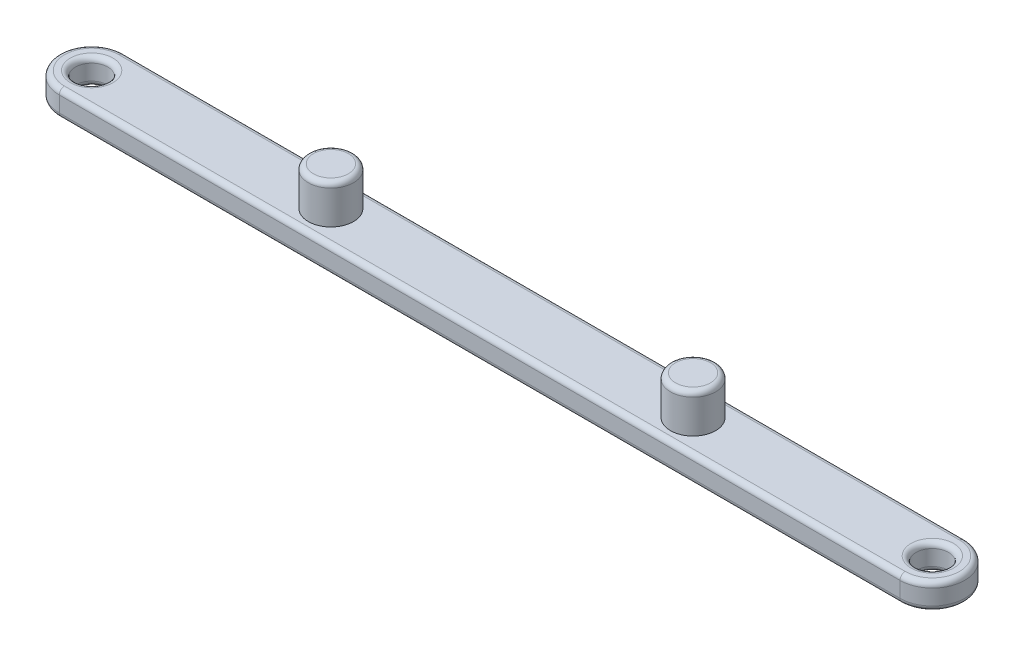
ISO-10303-21;
HEADER;
FILE_DESCRIPTION(('STEP AP214'),'2;1');
FILE_NAME('part.step','',(''),(''),'','','');
FILE_SCHEMA(('AUTOMOTIVE_DESIGN { 1 0 10303 214 1 1 1 1 }'));
ENDSEC;
DATA;
#1=APPLICATION_CONTEXT('core data for automotive mechanical design processes');
#2=APPLICATION_PROTOCOL_DEFINITION('international standard','automotive_design',2000,#1);
#3=PRODUCT_CONTEXT('',#1,'mechanical');
#4=PRODUCT('Part','Part','',(#3));
#5=PRODUCT_RELATED_PRODUCT_CATEGORY('part','',(#4));
#6=PRODUCT_DEFINITION_FORMATION('','',#4);
#7=PRODUCT_DEFINITION_CONTEXT('part definition',#1,'design');
#8=PRODUCT_DEFINITION('design','',#6,#7);
#9=PRODUCT_DEFINITION_SHAPE('','',#8);
#10=(LENGTH_UNIT() NAMED_UNIT(*) SI_UNIT(.MILLI.,.METRE.));
#11=(NAMED_UNIT(*) PLANE_ANGLE_UNIT() SI_UNIT($,.RADIAN.));
#12=(NAMED_UNIT(*) SI_UNIT($,.STERADIAN.) SOLID_ANGLE_UNIT());
#13=UNCERTAINTY_MEASURE_WITH_UNIT(LENGTH_MEASURE(1.E-05),#10,'distance_accuracy_value','');
#14=(GEOMETRIC_REPRESENTATION_CONTEXT(3) GLOBAL_UNCERTAINTY_ASSIGNED_CONTEXT((#13)) GLOBAL_UNIT_ASSIGNED_CONTEXT((#10,
#11,#12)) REPRESENTATION_CONTEXT('',''));
#15=CARTESIAN_POINT('',(0.,0.,0.));
#16=DIRECTION('',(0.,0.,1.));
#17=DIRECTION('',(1.,0.,0.));
#18=AXIS2_PLACEMENT_3D('',#15,#16,#17);
#19=CARTESIAN_POINT('',(-32.5,2.,0.));
#20=DIRECTION('',(0.,1.,0.));
#21=DIRECTION('',(0.,0.,1.));
#22=AXIS2_PLACEMENT_3D('',#19,#20,#21);
#23=PLANE('',#22);
#24=CARTESIAN_POINT('',(-32.5,2.,0.));
#25=DIRECTION('',(0.,1.,0.));
#26=DIRECTION('',(0.,0.,1.));
#27=AXIS2_PLACEMENT_3D('',#24,#25,#26);
#28=CIRCLE('',#27,1.65);
#29=CARTESIAN_POINT('',(-32.5,2.,1.65));
#30=VERTEX_POINT('',#29);
#31=EDGE_CURVE('E136',#30,#30,#28,.F.);
#32=ORIENTED_EDGE('',*,*,#31,.T.);
#33=EDGE_LOOP('',(#32));
#34=FACE_BOUND('',#33,.T.);
#35=CARTESIAN_POINT('',(32.5,2.,0.));
#36=DIRECTION('',(0.,1.,0.));
#37=DIRECTION('',(0.,0.,1.));
#38=AXIS2_PLACEMENT_3D('',#35,#36,#37);
#39=CIRCLE('',#38,1.65);
#40=CARTESIAN_POINT('',(32.5,2.,1.64999999999999));
#41=VERTEX_POINT('',#40);
#42=EDGE_CURVE('E133',#41,#41,#39,.F.);
#43=ORIENTED_EDGE('',*,*,#42,.T.);
#44=EDGE_LOOP('',(#43));
#45=FACE_BOUND('',#44,.T.);
#46=DIRECTION('',(-1.,0.,0.));
#47=VECTOR('',#46,1.);
#48=CARTESIAN_POINT('',(-32.5,2.,-2.1));
#49=LINE('',#48,#47);
#50=CARTESIAN_POINT('',(32.5,2.,-2.10000000000001));
#51=VERTEX_POINT('',#50);
#52=CARTESIAN_POINT('',(-32.5,2.,-2.1));
#53=VERTEX_POINT('',#52);
#54=EDGE_CURVE('E131',#51,#53,#49,.T.);
#55=ORIENTED_EDGE('',*,*,#54,.T.);
#56=CARTESIAN_POINT('',(-32.5,2.,0.));
#57=DIRECTION('',(0.,1.,0.));
#58=DIRECTION('',(0.,0.,1.));
#59=AXIS2_PLACEMENT_3D('',#56,#57,#58);
#60=CIRCLE('',#59,2.1);
#61=CARTESIAN_POINT('',(-32.5,2.,2.1));
#62=VERTEX_POINT('',#61);
#63=EDGE_CURVE('E112',#53,#62,#60,.T.);
#64=ORIENTED_EDGE('',*,*,#63,.T.);
#65=DIRECTION('',(1.,0.,0.));
#66=VECTOR('',#65,1.);
#67=CARTESIAN_POINT('',(32.5,2.,2.09999999999999));
#68=LINE('',#67,#66);
#69=CARTESIAN_POINT('',(32.5,2.,2.09999999999999));
#70=VERTEX_POINT('',#69);
#71=EDGE_CURVE('E120',#62,#70,#68,.T.);
#72=ORIENTED_EDGE('',*,*,#71,.T.);
#73=CARTESIAN_POINT('',(32.5,2.,0.));
#74=DIRECTION('',(0.,1.,0.));
#75=DIRECTION('',(0.,0.,1.));
#76=AXIS2_PLACEMENT_3D('',#73,#74,#75);
#77=CIRCLE('',#76,2.1);
#78=EDGE_CURVE('E126',#70,#51,#77,.T.);
#79=ORIENTED_EDGE('',*,*,#78,.T.);
#80=EDGE_LOOP('',(#55,#64,#72,#79));
#81=FACE_BOUND('',#80,.T.);
#82=CARTESIAN_POINT('',(-14.,2.,0.));
#83=DIRECTION('',(0.,1.,0.));
#84=DIRECTION('',(0.,0.,1.));
#85=AXIS2_PLACEMENT_3D('',#82,#83,#84);
#86=CIRCLE('',#85,1.75);
#87=CARTESIAN_POINT('',(-14.,2.,1.75));
#88=VERTEX_POINT('',#87);
#89=EDGE_CURVE('E198',#88,#88,#86,.T.);
#90=ORIENTED_EDGE('',*,*,#89,.F.);
#91=EDGE_LOOP('',(#90));
#92=FACE_BOUND('',#91,.T.);
#93=CARTESIAN_POINT('',(14.,2.,0.));
#94=DIRECTION('',(0.,1.,0.));
#95=DIRECTION('',(0.,0.,1.));
#96=AXIS2_PLACEMENT_3D('',#93,#94,#95);
#97=CIRCLE('',#96,1.75);
#98=CARTESIAN_POINT('',(14.,2.,1.75));
#99=VERTEX_POINT('',#98);
#100=EDGE_CURVE('E246',#99,#99,#97,.T.);
#101=ORIENTED_EDGE('',*,*,#100,.F.);
#102=EDGE_LOOP('',(#101));
#103=FACE_BOUND('',#102,.T.);
#104=ADVANCED_FACE('F39',(#34,#45,#81,#92,#103),#23,.T.);
#105=CARTESIAN_POINT('',(-32.5,0.,0.));
#106=DIRECTION('',(0.,1.,0.));
#107=DIRECTION('',(0.,0.,1.));
#108=AXIS2_PLACEMENT_3D('',#105,#106,#107);
#109=PLANE('',#108);
#110=CARTESIAN_POINT('',(-32.5,0.,0.));
#111=DIRECTION('',(0.,1.,0.));
#112=DIRECTION('',(0.,0.,1.));
#113=AXIS2_PLACEMENT_3D('',#110,#111,#112);
#114=CIRCLE('',#113,1.65);
#115=CARTESIAN_POINT('',(-32.5,0.,1.65));
#116=VERTEX_POINT('',#115);
#117=EDGE_CURVE('E165',#116,#116,#114,.T.);
#118=ORIENTED_EDGE('',*,*,#117,.T.);
#119=EDGE_LOOP('',(#118));
#120=FACE_BOUND('',#119,.T.);
#121=CARTESIAN_POINT('',(32.5,0.,0.));
#122=DIRECTION('',(0.,1.,0.));
#123=DIRECTION('',(0.,0.,1.));
#124=AXIS2_PLACEMENT_3D('',#121,#122,#123);
#125=CIRCLE('',#124,1.65);
#126=CARTESIAN_POINT('',(32.5,0.,1.64999999999999));
#127=VERTEX_POINT('',#126);
#128=EDGE_CURVE('E162',#127,#127,#125,.T.);
#129=ORIENTED_EDGE('',*,*,#128,.T.);
#130=EDGE_LOOP('',(#129));
#131=FACE_BOUND('',#130,.T.);
#132=DIRECTION('',(1.,0.,0.));
#133=VECTOR('',#132,1.);
#134=CARTESIAN_POINT('',(-32.5,0.,2.1));
#135=LINE('',#134,#133);
#136=CARTESIAN_POINT('',(32.5,0.,2.09999999999999));
#137=VERTEX_POINT('',#136);
#138=CARTESIAN_POINT('',(-32.5,0.,2.1));
#139=VERTEX_POINT('',#138);
#140=EDGE_CURVE('E155',#137,#139,#135,.F.);
#141=ORIENTED_EDGE('',*,*,#140,.T.);
#142=CARTESIAN_POINT('',(-32.5,0.,0.));
#143=DIRECTION('',(0.,1.,0.));
#144=DIRECTION('',(0.,0.,1.));
#145=AXIS2_PLACEMENT_3D('',#142,#143,#144);
#146=CIRCLE('',#145,2.1);
#147=CARTESIAN_POINT('',(-32.5,0.,-2.1));
#148=VERTEX_POINT('',#147);
#149=EDGE_CURVE('E160',#139,#148,#146,.F.);
#150=ORIENTED_EDGE('',*,*,#149,.T.);
#151=DIRECTION('',(-1.,0.,0.));
#152=VECTOR('',#151,1.);
#153=CARTESIAN_POINT('',(-32.5,0.,-2.1));
#154=LINE('',#153,#152);
#155=CARTESIAN_POINT('',(32.5,0.,-2.10000000000001));
#156=VERTEX_POINT('',#155);
#157=EDGE_CURVE('E63',#148,#156,#154,.F.);
#158=ORIENTED_EDGE('',*,*,#157,.T.);
#159=CARTESIAN_POINT('',(32.5,0.,0.));
#160=DIRECTION('',(0.,1.,0.));
#161=DIRECTION('',(0.,0.,1.));
#162=AXIS2_PLACEMENT_3D('',#159,#160,#161);
#163=CIRCLE('',#162,2.1);
#164=EDGE_CURVE('E157',#156,#137,#163,.F.);
#165=ORIENTED_EDGE('',*,*,#164,.T.);
#166=EDGE_LOOP('',(#141,#150,#158,#165));
#167=FACE_BOUND('',#166,.T.);
#168=ADVANCED_FACE('F215',(#120,#131,#167),#109,.F.);
#169=CARTESIAN_POINT('',(-32.5,2.,0.));
#170=DIRECTION('',(0.,-1.,0.));
#171=DIRECTION('',(0.,0.,-1.));
#172=AXIS2_PLACEMENT_3D('',#169,#170,#171);
#173=CYLINDRICAL_SURFACE('',#172,2.5);
#174=DIRECTION('',(0.,-1.,0.));
#175=VECTOR('',#174,1.);
#176=CARTESIAN_POINT('',(-32.5,2.,2.5));
#177=LINE('',#176,#175);
#178=CARTESIAN_POINT('',(-32.5,1.6,2.5));
#179=VERTEX_POINT('',#178);
#180=CARTESIAN_POINT('',(-32.5,0.4,2.5));
#181=VERTEX_POINT('',#180);
#182=EDGE_CURVE('E127',#179,#181,#177,.T.);
#183=ORIENTED_EDGE('',*,*,#182,.F.);
#184=CARTESIAN_POINT('',(-32.5,1.6,0.));
#185=DIRECTION('',(0.,1.,0.));
#186=DIRECTION('',(0.,0.,1.));
#187=AXIS2_PLACEMENT_3D('',#184,#185,#186);
#188=CIRCLE('',#187,2.5);
#189=CARTESIAN_POINT('',(-32.5,1.6,-2.5));
#190=VERTEX_POINT('',#189);
#191=EDGE_CURVE('E114',#179,#190,#188,.F.);
#192=ORIENTED_EDGE('',*,*,#191,.T.);
#193=DIRECTION('',(0.,-1.,0.));
#194=VECTOR('',#193,1.);
#195=CARTESIAN_POINT('',(-32.5,2.,-2.5));
#196=LINE('',#195,#194);
#197=CARTESIAN_POINT('',(-32.5,0.4,-2.5));
#198=VERTEX_POINT('',#197);
#199=EDGE_CURVE('E228',#190,#198,#196,.T.);
#200=ORIENTED_EDGE('',*,*,#199,.T.);
#201=CARTESIAN_POINT('',(-32.5,0.4,0.));
#202=DIRECTION('',(0.,1.,0.));
#203=DIRECTION('',(0.,0.,1.));
#204=AXIS2_PLACEMENT_3D('',#201,#202,#203);
#205=CIRCLE('',#204,2.5);
#206=EDGE_CURVE('E143',#198,#181,#205,.T.);
#207=ORIENTED_EDGE('',*,*,#206,.T.);
#208=EDGE_LOOP('',(#183,#192,#200,#207));
#209=FACE_BOUND('',#208,.T.);
#210=ADVANCED_FACE('F226',(#209),#173,.T.);
#211=CARTESIAN_POINT('',(-32.5,2.,2.5));
#212=DIRECTION('',(0.,0.,-1.));
#213=DIRECTION('',(-1.,0.,0.));
#214=AXIS2_PLACEMENT_3D('',#211,#212,#213);
#215=PLANE('',#214);
#216=DIRECTION('',(0.,-1.,0.));
#217=VECTOR('',#216,1.);
#218=CARTESIAN_POINT('',(32.5,2.,2.49999999999999));
#219=LINE('',#218,#217);
#220=CARTESIAN_POINT('',(32.5,1.6,2.49999999999999));
#221=VERTEX_POINT('',#220);
#222=CARTESIAN_POINT('',(32.5,0.4,2.49999999999999));
#223=VERTEX_POINT('',#222);
#224=EDGE_CURVE('E230',#221,#223,#219,.T.);
#225=ORIENTED_EDGE('',*,*,#224,.F.);
#226=DIRECTION('',(1.,0.,0.));
#227=VECTOR('',#226,1.);
#228=CARTESIAN_POINT('',(-32.5,1.6,2.5));
#229=LINE('',#228,#227);
#230=EDGE_CURVE('E11',#221,#179,#229,.F.);
#231=ORIENTED_EDGE('',*,*,#230,.T.);
#232=ORIENTED_EDGE('',*,*,#182,.T.);
#233=DIRECTION('',(1.,0.,0.));
#234=VECTOR('',#233,1.);
#235=CARTESIAN_POINT('',(-32.5,0.4,2.5));
#236=LINE('',#235,#234);
#237=EDGE_CURVE('E48',#181,#223,#236,.T.);
#238=ORIENTED_EDGE('',*,*,#237,.T.);
#239=EDGE_LOOP('',(#225,#231,#232,#238));
#240=FACE_BOUND('',#239,.T.);
#241=ADVANCED_FACE('F229',(#240),#215,.F.);
#242=CARTESIAN_POINT('',(32.5,2.,0.));
#243=DIRECTION('',(0.,-1.,0.));
#244=DIRECTION('',(0.,0.,-1.));
#245=AXIS2_PLACEMENT_3D('',#242,#243,#244);
#246=CYLINDRICAL_SURFACE('',#245,2.5);
#247=DIRECTION('',(0.,-1.,0.));
#248=VECTOR('',#247,1.);
#249=CARTESIAN_POINT('',(32.5,2.,-2.50000000000001));
#250=LINE('',#249,#248);
#251=CARTESIAN_POINT('',(32.5,1.6,-2.50000000000001));
#252=VERTEX_POINT('',#251);
#253=CARTESIAN_POINT('',(32.5,0.4,-2.50000000000001));
#254=VERTEX_POINT('',#253);
#255=EDGE_CURVE('E232',#252,#254,#250,.T.);
#256=ORIENTED_EDGE('',*,*,#255,.F.);
#257=CARTESIAN_POINT('',(32.5,1.6,0.));
#258=DIRECTION('',(0.,1.,0.));
#259=DIRECTION('',(0.,0.,1.));
#260=AXIS2_PLACEMENT_3D('',#257,#258,#259);
#261=CIRCLE('',#260,2.5);
#262=EDGE_CURVE('E153',#252,#221,#261,.F.);
#263=ORIENTED_EDGE('',*,*,#262,.T.);
#264=ORIENTED_EDGE('',*,*,#224,.T.);
#265=CARTESIAN_POINT('',(32.5,0.4,0.));
#266=DIRECTION('',(0.,1.,0.));
#267=DIRECTION('',(0.,0.,1.));
#268=AXIS2_PLACEMENT_3D('',#265,#266,#267);
#269=CIRCLE('',#268,2.5);
#270=EDGE_CURVE('E151',#223,#254,#269,.T.);
#271=ORIENTED_EDGE('',*,*,#270,.T.);
#272=EDGE_LOOP('',(#256,#263,#264,#271));
#273=FACE_BOUND('',#272,.T.);
#274=ADVANCED_FACE('F286',(#273),#246,.T.);
#275=CARTESIAN_POINT('',(-32.5,2.,-2.5));
#276=DIRECTION('',(0.,0.,1.));
#277=DIRECTION('',(1.,0.,0.));
#278=AXIS2_PLACEMENT_3D('',#275,#276,#277);
#279=PLANE('',#278);
#280=ORIENTED_EDGE('',*,*,#199,.F.);
#281=DIRECTION('',(-1.,0.,0.));
#282=VECTOR('',#281,1.);
#283=CARTESIAN_POINT('',(32.5,1.6,-2.50000000000001));
#284=LINE('',#283,#282);
#285=EDGE_CURVE('E149',#190,#252,#284,.F.);
#286=ORIENTED_EDGE('',*,*,#285,.T.);
#287=ORIENTED_EDGE('',*,*,#255,.T.);
#288=DIRECTION('',(-1.,0.,0.));
#289=VECTOR('',#288,1.);
#290=CARTESIAN_POINT('',(-32.5,0.4,-2.5));
#291=LINE('',#290,#289);
#292=EDGE_CURVE('E147',#254,#198,#291,.T.);
#293=ORIENTED_EDGE('',*,*,#292,.T.);
#294=EDGE_LOOP('',(#280,#286,#287,#293));
#295=FACE_BOUND('',#294,.T.);
#296=ADVANCED_FACE('F245',(#295),#279,.F.);
#297=CARTESIAN_POINT('',(-32.5,2.,0.));
#298=DIRECTION('',(0.,-1.,0.));
#299=DIRECTION('',(0.,0.,-1.));
#300=AXIS2_PLACEMENT_3D('',#297,#298,#299);
#301=CYLINDRICAL_SURFACE('',#300,1.25);
#302=CARTESIAN_POINT('',(-32.5,0.4,0.));
#303=DIRECTION('',(0.,1.,0.));
#304=DIRECTION('',(0.,0.,1.));
#305=AXIS2_PLACEMENT_3D('',#302,#303,#304);
#306=CIRCLE('',#305,1.25);
#307=CARTESIAN_POINT('',(-32.5,0.4,1.25));
#308=VERTEX_POINT('',#307);
#309=EDGE_CURVE('E183',#308,#308,#306,.F.);
#310=ORIENTED_EDGE('',*,*,#309,.T.);
#311=EDGE_LOOP('',(#310));
#312=FACE_BOUND('',#311,.T.);
#313=CARTESIAN_POINT('',(-32.5,1.6,0.));
#314=DIRECTION('',(0.,1.,0.));
#315=DIRECTION('',(0.,0.,1.));
#316=AXIS2_PLACEMENT_3D('',#313,#314,#315);
#317=CIRCLE('',#316,1.25);
#318=CARTESIAN_POINT('',(-32.5,1.6,1.25));
#319=VERTEX_POINT('',#318);
#320=EDGE_CURVE('E180',#319,#319,#317,.T.);
#321=ORIENTED_EDGE('',*,*,#320,.T.);
#322=EDGE_LOOP('',(#321));
#323=FACE_BOUND('',#322,.T.);
#324=ADVANCED_FACE('F273',(#312,#323),#301,.F.);
#325=CARTESIAN_POINT('',(32.5,2.,0.));
#326=DIRECTION('',(0.,-1.,0.));
#327=DIRECTION('',(0.,0.,-1.));
#328=AXIS2_PLACEMENT_3D('',#325,#326,#327);
#329=CYLINDRICAL_SURFACE('',#328,1.25);
#330=CARTESIAN_POINT('',(32.5,0.4,0.));
#331=DIRECTION('',(0.,1.,0.));
#332=DIRECTION('',(0.,0.,1.));
#333=AXIS2_PLACEMENT_3D('',#330,#331,#332);
#334=CIRCLE('',#333,1.25);
#335=CARTESIAN_POINT('',(32.5,0.4,1.24999999999999));
#336=VERTEX_POINT('',#335);
#337=EDGE_CURVE('E189',#336,#336,#334,.F.);
#338=ORIENTED_EDGE('',*,*,#337,.T.);
#339=EDGE_LOOP('',(#338));
#340=FACE_BOUND('',#339,.T.);
#341=CARTESIAN_POINT('',(32.5,1.6,0.));
#342=DIRECTION('',(0.,1.,0.));
#343=DIRECTION('',(0.,0.,1.));
#344=AXIS2_PLACEMENT_3D('',#341,#342,#343);
#345=CIRCLE('',#344,1.25);
#346=CARTESIAN_POINT('',(32.5,1.6,1.24999999999999));
#347=VERTEX_POINT('',#346);
#348=EDGE_CURVE('E186',#347,#347,#345,.T.);
#349=ORIENTED_EDGE('',*,*,#348,.T.);
#350=EDGE_LOOP('',(#349));
#351=FACE_BOUND('',#350,.T.);
#352=ADVANCED_FACE('F264',(#340,#351),#329,.F.);
#353=CARTESIAN_POINT('',(14.,5.,0.));
#354=DIRECTION('',(0.,-1.,0.));
#355=DIRECTION('',(0.,0.,-1.));
#356=AXIS2_PLACEMENT_3D('',#353,#354,#355);
#357=CYLINDRICAL_SURFACE('',#356,1.75);
#358=CARTESIAN_POINT('',(14.,4.6,0.));
#359=DIRECTION('',(0.,1.,0.));
#360=DIRECTION('',(0.,0.,1.));
#361=AXIS2_PLACEMENT_3D('',#358,#359,#360);
#362=CIRCLE('',#361,1.75);
#363=CARTESIAN_POINT('',(14.,4.6,1.75));
#364=VERTEX_POINT('',#363);
#365=EDGE_CURVE('E171',#364,#364,#362,.F.);
#366=ORIENTED_EDGE('',*,*,#365,.T.);
#367=EDGE_LOOP('',(#366));
#368=FACE_BOUND('',#367,.T.);
#369=ORIENTED_EDGE('',*,*,#100,.T.);
#370=EDGE_LOOP('',(#369));
#371=FACE_BOUND('',#370,.T.);
#372=ADVANCED_FACE('F261',(#368,#371),#357,.T.);
#373=CARTESIAN_POINT('',(14.,5.,0.));
#374=DIRECTION('',(0.,1.,0.));
#375=DIRECTION('',(0.,0.,1.));
#376=AXIS2_PLACEMENT_3D('',#373,#374,#375);
#377=PLANE('',#376);
#378=CARTESIAN_POINT('',(14.,5.,0.));
#379=DIRECTION('',(0.,1.,0.));
#380=DIRECTION('',(0.,0.,1.));
#381=AXIS2_PLACEMENT_3D('',#378,#379,#380);
#382=CIRCLE('',#381,1.35);
#383=CARTESIAN_POINT('',(14.,5.,1.35));
#384=VERTEX_POINT('',#383);
#385=EDGE_CURVE('E168',#384,#384,#382,.T.);
#386=ORIENTED_EDGE('',*,*,#385,.T.);
#387=EDGE_LOOP('',(#386));
#388=FACE_BOUND('',#387,.T.);
#389=ADVANCED_FACE('F263',(#388),#377,.T.);
#390=CARTESIAN_POINT('',(-14.,5.,0.));
#391=DIRECTION('',(0.,-1.,0.));
#392=DIRECTION('',(0.,0.,-1.));
#393=AXIS2_PLACEMENT_3D('',#390,#391,#392);
#394=CYLINDRICAL_SURFACE('',#393,1.75);
#395=CARTESIAN_POINT('',(-14.,4.6,0.));
#396=DIRECTION('',(0.,1.,0.));
#397=DIRECTION('',(0.,0.,1.));
#398=AXIS2_PLACEMENT_3D('',#395,#396,#397);
#399=CIRCLE('',#398,1.75);
#400=CARTESIAN_POINT('',(-14.,4.6,1.75));
#401=VERTEX_POINT('',#400);
#402=EDGE_CURVE('E177',#401,#401,#399,.F.);
#403=ORIENTED_EDGE('',*,*,#402,.T.);
#404=EDGE_LOOP('',(#403));
#405=FACE_BOUND('',#404,.T.);
#406=ORIENTED_EDGE('',*,*,#89,.T.);
#407=EDGE_LOOP('',(#406));
#408=FACE_BOUND('',#407,.T.);
#409=ADVANCED_FACE('F254',(#405,#408),#394,.T.);
#410=CARTESIAN_POINT('',(-14.,5.,0.));
#411=DIRECTION('',(0.,1.,0.));
#412=DIRECTION('',(0.,0.,1.));
#413=AXIS2_PLACEMENT_3D('',#410,#411,#412);
#414=PLANE('',#413);
#415=CARTESIAN_POINT('',(-14.,5.,0.));
#416=DIRECTION('',(0.,1.,0.));
#417=DIRECTION('',(0.,0.,1.));
#418=AXIS2_PLACEMENT_3D('',#415,#416,#417);
#419=CIRCLE('',#418,1.35);
#420=CARTESIAN_POINT('',(-14.,5.,1.35));
#421=VERTEX_POINT('',#420);
#422=EDGE_CURVE('E174',#421,#421,#419,.T.);
#423=ORIENTED_EDGE('',*,*,#422,.T.);
#424=EDGE_LOOP('',(#423));
#425=FACE_BOUND('',#424,.T.);
#426=ADVANCED_FACE('F302',(#425),#414,.T.);
#427=CARTESIAN_POINT('',(32.5,1.6,0.));
#428=DIRECTION('',(0.,1.,0.));
#429=DIRECTION('',(0.,0.,1.));
#430=AXIS2_PLACEMENT_3D('',#427,#428,#429);
#431=TOROIDAL_SURFACE('',#430,2.1,0.4);
#432=CARTESIAN_POINT('',(32.5,1.6,2.09999999999999));
#433=DIRECTION('',(-1.,0.,0.));
#434=DIRECTION('',(0.,0.,1.));
#435=AXIS2_PLACEMENT_3D('',#432,#433,#434);
#436=CIRCLE('',#435,0.4);
#437=EDGE_CURVE('E123',#221,#70,#436,.T.);
#438=ORIENTED_EDGE('',*,*,#437,.F.);
#439=ORIENTED_EDGE('',*,*,#262,.F.);
#440=CARTESIAN_POINT('',(32.5,1.6,-2.10000000000001));
#441=DIRECTION('',(-1.,0.,0.));
#442=DIRECTION('',(0.,0.,1.));
#443=AXIS2_PLACEMENT_3D('',#440,#441,#442);
#444=CIRCLE('',#443,0.4);
#445=EDGE_CURVE('E195',#51,#252,#444,.T.);
#446=ORIENTED_EDGE('',*,*,#445,.F.);
#447=ORIENTED_EDGE('',*,*,#78,.F.);
#448=EDGE_LOOP('',(#438,#439,#446,#447));
#449=FACE_BOUND('',#448,.T.);
#450=ADVANCED_FACE('F238',(#449),#431,.T.);
#451=CARTESIAN_POINT('',(-32.5,1.6,-2.1));
#452=DIRECTION('',(1.,0.,0.));
#453=DIRECTION('',(0.,0.,-1.));
#454=AXIS2_PLACEMENT_3D('',#451,#452,#453);
#455=CYLINDRICAL_SURFACE('',#454,0.4);
#456=ORIENTED_EDGE('',*,*,#445,.T.);
#457=ORIENTED_EDGE('',*,*,#285,.F.);
#458=CARTESIAN_POINT('',(-32.5,1.6,-2.1));
#459=DIRECTION('',(-1.,0.,0.));
#460=DIRECTION('',(0.,0.,1.));
#461=AXIS2_PLACEMENT_3D('',#458,#459,#460);
#462=CIRCLE('',#461,0.4);
#463=EDGE_CURVE('E117',#53,#190,#462,.T.);
#464=ORIENTED_EDGE('',*,*,#463,.F.);
#465=ORIENTED_EDGE('',*,*,#54,.F.);
#466=EDGE_LOOP('',(#456,#457,#464,#465));
#467=FACE_BOUND('',#466,.T.);
#468=ADVANCED_FACE('F241',(#467),#455,.T.);
#469=CARTESIAN_POINT('',(-32.5,1.6,2.1));
#470=DIRECTION('',(-1.,0.,0.));
#471=DIRECTION('',(0.,0.,1.));
#472=AXIS2_PLACEMENT_3D('',#469,#470,#471);
#473=CYLINDRICAL_SURFACE('',#472,0.4);
#474=ORIENTED_EDGE('',*,*,#437,.T.);
#475=ORIENTED_EDGE('',*,*,#71,.F.);
#476=CARTESIAN_POINT('',(-32.5,1.6,2.1));
#477=DIRECTION('',(-1.,0.,0.));
#478=DIRECTION('',(0.,0.,1.));
#479=AXIS2_PLACEMENT_3D('',#476,#477,#478);
#480=CIRCLE('',#479,0.4);
#481=EDGE_CURVE('E108',#179,#62,#480,.T.);
#482=ORIENTED_EDGE('',*,*,#481,.F.);
#483=ORIENTED_EDGE('',*,*,#230,.F.);
#484=EDGE_LOOP('',(#474,#475,#482,#483));
#485=FACE_BOUND('',#484,.T.);
#486=ADVANCED_FACE('F121',(#485),#473,.T.);
#487=CARTESIAN_POINT('',(-32.5,1.6,0.));
#488=DIRECTION('',(0.,1.,0.));
#489=DIRECTION('',(0.,0.,1.));
#490=AXIS2_PLACEMENT_3D('',#487,#488,#489);
#491=TOROIDAL_SURFACE('',#490,2.1,0.4);
#492=ORIENTED_EDGE('',*,*,#463,.T.);
#493=ORIENTED_EDGE('',*,*,#191,.F.);
#494=ORIENTED_EDGE('',*,*,#481,.T.);
#495=ORIENTED_EDGE('',*,*,#63,.F.);
#496=EDGE_LOOP('',(#492,#493,#494,#495));
#497=FACE_BOUND('',#496,.T.);
#498=ADVANCED_FACE('F110',(#497),#491,.T.);
#499=CARTESIAN_POINT('',(32.5,0.4,0.));
#500=DIRECTION('',(0.,1.,0.));
#501=DIRECTION('',(0.,0.,1.));
#502=AXIS2_PLACEMENT_3D('',#499,#500,#501);
#503=TOROIDAL_SURFACE('',#502,2.1,0.4);
#504=CARTESIAN_POINT('',(32.5,0.4,2.09999999999999));
#505=DIRECTION('',(-1.,0.,0.));
#506=DIRECTION('',(0.,0.,1.));
#507=AXIS2_PLACEMENT_3D('',#504,#505,#506);
#508=CIRCLE('',#507,0.4);
#509=EDGE_CURVE('E201',#137,#223,#508,.T.);
#510=ORIENTED_EDGE('',*,*,#509,.F.);
#511=ORIENTED_EDGE('',*,*,#164,.F.);
#512=CARTESIAN_POINT('',(32.5,0.4,-2.10000000000001));
#513=DIRECTION('',(-1.,0.,0.));
#514=DIRECTION('',(0.,0.,1.));
#515=AXIS2_PLACEMENT_3D('',#512,#513,#514);
#516=CIRCLE('',#515,0.4);
#517=EDGE_CURVE('E43',#254,#156,#516,.T.);
#518=ORIENTED_EDGE('',*,*,#517,.F.);
#519=ORIENTED_EDGE('',*,*,#270,.F.);
#520=EDGE_LOOP('',(#510,#511,#518,#519));
#521=FACE_BOUND('',#520,.T.);
#522=ADVANCED_FACE('F214',(#521),#503,.T.);
#523=CARTESIAN_POINT('',(-32.5,0.4,-2.1));
#524=DIRECTION('',(-1.,0.,0.));
#525=DIRECTION('',(0.,0.,1.));
#526=AXIS2_PLACEMENT_3D('',#523,#524,#525);
#527=CYLINDRICAL_SURFACE('',#526,0.4);
#528=ORIENTED_EDGE('',*,*,#517,.T.);
#529=ORIENTED_EDGE('',*,*,#157,.F.);
#530=CARTESIAN_POINT('',(-32.5,0.4,-2.1));
#531=DIRECTION('',(-1.,0.,0.));
#532=DIRECTION('',(0.,0.,1.));
#533=AXIS2_PLACEMENT_3D('',#530,#531,#532);
#534=CIRCLE('',#533,0.4);
#535=EDGE_CURVE('E56',#198,#148,#534,.T.);
#536=ORIENTED_EDGE('',*,*,#535,.F.);
#537=ORIENTED_EDGE('',*,*,#292,.F.);
#538=EDGE_LOOP('',(#528,#529,#536,#537));
#539=FACE_BOUND('',#538,.T.);
#540=ADVANCED_FACE('F211',(#539),#527,.T.);
#541=CARTESIAN_POINT('',(-32.5,0.4,2.1));
#542=DIRECTION('',(1.,0.,0.));
#543=DIRECTION('',(0.,0.,-1.));
#544=AXIS2_PLACEMENT_3D('',#541,#542,#543);
#545=CYLINDRICAL_SURFACE('',#544,0.4);
#546=ORIENTED_EDGE('',*,*,#509,.T.);
#547=ORIENTED_EDGE('',*,*,#237,.F.);
#548=CARTESIAN_POINT('',(-32.5,0.4,2.1));
#549=DIRECTION('',(-1.,0.,0.));
#550=DIRECTION('',(0.,0.,1.));
#551=AXIS2_PLACEMENT_3D('',#548,#549,#550);
#552=CIRCLE('',#551,0.4);
#553=EDGE_CURVE('E199',#139,#181,#552,.T.);
#554=ORIENTED_EDGE('',*,*,#553,.F.);
#555=ORIENTED_EDGE('',*,*,#140,.F.);
#556=EDGE_LOOP('',(#546,#547,#554,#555));
#557=FACE_BOUND('',#556,.T.);
#558=ADVANCED_FACE('F218',(#557),#545,.T.);
#559=CARTESIAN_POINT('',(-32.5,0.4,0.));
#560=DIRECTION('',(0.,1.,0.));
#561=DIRECTION('',(0.,0.,1.));
#562=AXIS2_PLACEMENT_3D('',#559,#560,#561);
#563=TOROIDAL_SURFACE('',#562,2.1,0.4);
#564=ORIENTED_EDGE('',*,*,#535,.T.);
#565=ORIENTED_EDGE('',*,*,#149,.F.);
#566=ORIENTED_EDGE('',*,*,#553,.T.);
#567=ORIENTED_EDGE('',*,*,#206,.F.);
#568=EDGE_LOOP('',(#564,#565,#566,#567));
#569=FACE_BOUND('',#568,.T.);
#570=ADVANCED_FACE('F217',(#569),#563,.T.);
#571=CARTESIAN_POINT('',(14.,4.6,0.));
#572=DIRECTION('',(0.,1.,0.));
#573=DIRECTION('',(0.,0.,1.));
#574=AXIS2_PLACEMENT_3D('',#571,#572,#573);
#575=TOROIDAL_SURFACE('',#574,1.35,0.4);
#576=ORIENTED_EDGE('',*,*,#365,.F.);
#577=EDGE_LOOP('',(#576));
#578=FACE_BOUND('',#577,.T.);
#579=ORIENTED_EDGE('',*,*,#385,.F.);
#580=EDGE_LOOP('',(#579));
#581=FACE_BOUND('',#580,.T.);
#582=ADVANCED_FACE('F305',(#578,#581),#575,.T.);
#583=CARTESIAN_POINT('',(-14.,4.6,0.));
#584=DIRECTION('',(0.,1.,0.));
#585=DIRECTION('',(0.,0.,1.));
#586=AXIS2_PLACEMENT_3D('',#583,#584,#585);
#587=TOROIDAL_SURFACE('',#586,1.35,0.4);
#588=ORIENTED_EDGE('',*,*,#402,.F.);
#589=EDGE_LOOP('',(#588));
#590=FACE_BOUND('',#589,.T.);
#591=ORIENTED_EDGE('',*,*,#422,.F.);
#592=EDGE_LOOP('',(#591));
#593=FACE_BOUND('',#592,.T.);
#594=ADVANCED_FACE('F314',(#590,#593),#587,.T.);
#595=CARTESIAN_POINT('',(-32.5,0.4,0.));
#596=DIRECTION('',(0.,1.,0.));
#597=DIRECTION('',(0.,0.,1.));
#598=AXIS2_PLACEMENT_3D('',#595,#596,#597);
#599=TOROIDAL_SURFACE('',#598,1.65,0.4);
#600=ORIENTED_EDGE('',*,*,#309,.F.);
#601=EDGE_LOOP('',(#600));
#602=FACE_BOUND('',#601,.T.);
#603=ORIENTED_EDGE('',*,*,#117,.F.);
#604=EDGE_LOOP('',(#603));
#605=FACE_BOUND('',#604,.T.);
#606=ADVANCED_FACE('F318',(#602,#605),#599,.T.);
#607=CARTESIAN_POINT('',(-32.5,1.6,0.));
#608=DIRECTION('',(0.,1.,0.));
#609=DIRECTION('',(0.,0.,1.));
#610=AXIS2_PLACEMENT_3D('',#607,#608,#609);
#611=TOROIDAL_SURFACE('',#610,1.65,0.4);
#612=ORIENTED_EDGE('',*,*,#31,.F.);
#613=EDGE_LOOP('',(#612));
#614=FACE_BOUND('',#613,.T.);
#615=ORIENTED_EDGE('',*,*,#320,.F.);
#616=EDGE_LOOP('',(#615));
#617=FACE_BOUND('',#616,.T.);
#618=ADVANCED_FACE('F322',(#614,#617),#611,.T.);
#619=CARTESIAN_POINT('',(32.5,0.4,0.));
#620=DIRECTION('',(0.,1.,0.));
#621=DIRECTION('',(0.,0.,1.));
#622=AXIS2_PLACEMENT_3D('',#619,#620,#621);
#623=TOROIDAL_SURFACE('',#622,1.65,0.4);
#624=ORIENTED_EDGE('',*,*,#337,.F.);
#625=EDGE_LOOP('',(#624));
#626=FACE_BOUND('',#625,.T.);
#627=ORIENTED_EDGE('',*,*,#128,.F.);
#628=EDGE_LOOP('',(#627));
#629=FACE_BOUND('',#628,.T.);
#630=ADVANCED_FACE('F325',(#626,#629),#623,.T.);
#631=CARTESIAN_POINT('',(32.5,1.6,0.));
#632=DIRECTION('',(0.,1.,0.));
#633=DIRECTION('',(0.,0.,1.));
#634=AXIS2_PLACEMENT_3D('',#631,#632,#633);
#635=TOROIDAL_SURFACE('',#634,1.65,0.4);
#636=ORIENTED_EDGE('',*,*,#42,.F.);
#637=EDGE_LOOP('',(#636));
#638=FACE_BOUND('',#637,.T.);
#639=ORIENTED_EDGE('',*,*,#348,.F.);
#640=EDGE_LOOP('',(#639));
#641=FACE_BOUND('',#640,.T.);
#642=ADVANCED_FACE('F41',(#638,#641),#635,.T.);
#643=CLOSED_SHELL('',(#104,#168,#210,#241,#274,#296,#324,#352,#372,#389,#409,#426,#450,#468,
#486,#498,#522,#540,#558,#570,#582,#594,#606,#618,#630,#642));
#644=MANIFOLD_SOLID_BREP('B2',#643);
#645=ADVANCED_BREP_SHAPE_REPRESENTATION('',(#18,#644),#14);
#646=SHAPE_DEFINITION_REPRESENTATION(#9,#645);
ENDSEC;
END-ISO-10303-21;
